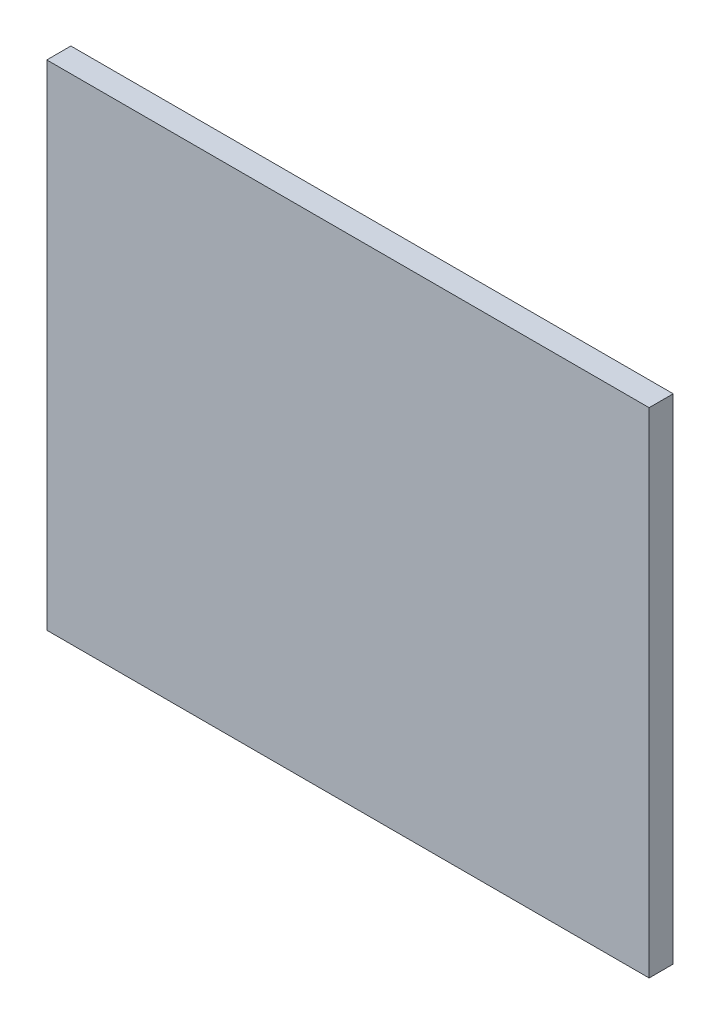
ISO-10303-21;
HEADER;
FILE_DESCRIPTION(('STEP AP214'),'2;1');
FILE_NAME('part.step','',(''),(''),'','','');
FILE_SCHEMA(('AUTOMOTIVE_DESIGN { 1 0 10303 214 1 1 1 1 }'));
ENDSEC;
DATA;
#1=APPLICATION_CONTEXT('core data for automotive mechanical design processes');
#2=APPLICATION_PROTOCOL_DEFINITION('international standard','automotive_design',2000,#1);
#3=PRODUCT_CONTEXT('',#1,'mechanical');
#4=PRODUCT('Part','Part','',(#3));
#5=PRODUCT_RELATED_PRODUCT_CATEGORY('part','',(#4));
#6=PRODUCT_DEFINITION_FORMATION('','',#4);
#7=PRODUCT_DEFINITION_CONTEXT('part definition',#1,'design');
#8=PRODUCT_DEFINITION('design','',#6,#7);
#9=PRODUCT_DEFINITION_SHAPE('','',#8);
#10=(LENGTH_UNIT() NAMED_UNIT(*) SI_UNIT(.MILLI.,.METRE.));
#11=(NAMED_UNIT(*) PLANE_ANGLE_UNIT() SI_UNIT($,.RADIAN.));
#12=(NAMED_UNIT(*) SI_UNIT($,.STERADIAN.) SOLID_ANGLE_UNIT());
#13=UNCERTAINTY_MEASURE_WITH_UNIT(LENGTH_MEASURE(1.E-05),#10,'distance_accuracy_value','');
#14=(GEOMETRIC_REPRESENTATION_CONTEXT(3) GLOBAL_UNCERTAINTY_ASSIGNED_CONTEXT((#13)) GLOBAL_UNIT_ASSIGNED_CONTEXT((#10,
#11,#12)) REPRESENTATION_CONTEXT('',''));
#15=CARTESIAN_POINT('',(0.,0.,0.));
#16=DIRECTION('',(0.,0.,1.));
#17=DIRECTION('',(1.,0.,0.));
#18=AXIS2_PLACEMENT_3D('',#15,#16,#17);
#19=CARTESIAN_POINT('',(20.,-10.25,1.));
#20=DIRECTION('',(-1.,0.,0.));
#21=DIRECTION('',(0.,0.,1.));
#22=AXIS2_PLACEMENT_3D('',#19,#20,#21);
#23=PLANE('',#22);
#24=DIRECTION('',(0.,1.,0.));
#25=VECTOR('',#24,1.);
#26=CARTESIAN_POINT('',(20.,-10.25,0.));
#27=LINE('',#26,#25);
#28=CARTESIAN_POINT('',(20.,-10.25,0.));
#29=VERTEX_POINT('',#28);
#30=CARTESIAN_POINT('',(20.,10.25,0.));
#31=VERTEX_POINT('',#30);
#32=EDGE_CURVE('E97',#29,#31,#27,.T.);
#33=ORIENTED_EDGE('',*,*,#32,.T.);
#34=DIRECTION('',(0.,0.,-1.));
#35=VECTOR('',#34,1.);
#36=CARTESIAN_POINT('',(20.,10.25,1.));
#37=LINE('',#36,#35);
#38=CARTESIAN_POINT('',(20.,10.25,1.));
#39=VERTEX_POINT('',#38);
#40=EDGE_CURVE('E11',#39,#31,#37,.T.);
#41=ORIENTED_EDGE('',*,*,#40,.F.);
#42=DIRECTION('',(0.,1.,0.));
#43=VECTOR('',#42,1.);
#44=CARTESIAN_POINT('',(20.,-10.25,1.));
#45=LINE('',#44,#43);
#46=CARTESIAN_POINT('',(20.,-10.25,1.));
#47=VERTEX_POINT('',#46);
#48=EDGE_CURVE('E85',#47,#39,#45,.T.);
#49=ORIENTED_EDGE('',*,*,#48,.F.);
#50=DIRECTION('',(0.,0.,-1.));
#51=VECTOR('',#50,1.);
#52=CARTESIAN_POINT('',(20.,-10.25,1.));
#53=LINE('',#52,#51);
#54=EDGE_CURVE('E93',#47,#29,#53,.T.);
#55=ORIENTED_EDGE('',*,*,#54,.T.);
#56=EDGE_LOOP('',(#33,#41,#49,#55));
#57=FACE_BOUND('',#56,.T.);
#58=ADVANCED_FACE('F34',(#57),#23,.F.);
#59=CARTESIAN_POINT('',(-5.,10.25,1.));
#60=DIRECTION('',(0.,-1.,0.));
#61=DIRECTION('',(0.,0.,-1.));
#62=AXIS2_PLACEMENT_3D('',#59,#60,#61);
#63=PLANE('',#62);
#64=DIRECTION('',(-1.,0.,0.));
#65=VECTOR('',#64,1.);
#66=CARTESIAN_POINT('',(-5.,10.25,0.));
#67=LINE('',#66,#65);
#68=CARTESIAN_POINT('',(-5.,10.25,0.));
#69=VERTEX_POINT('',#68);
#70=EDGE_CURVE('E89',#31,#69,#67,.T.);
#71=ORIENTED_EDGE('',*,*,#70,.T.);
#72=DIRECTION('',(0.,0.,-1.));
#73=VECTOR('',#72,1.);
#74=CARTESIAN_POINT('',(-5.,10.25,1.));
#75=LINE('',#74,#73);
#76=CARTESIAN_POINT('',(-5.,10.25,1.));
#77=VERTEX_POINT('',#76);
#78=EDGE_CURVE('E42',#77,#69,#75,.T.);
#79=ORIENTED_EDGE('',*,*,#78,.F.);
#80=DIRECTION('',(-1.,0.,0.));
#81=VECTOR('',#80,1.);
#82=CARTESIAN_POINT('',(-5.,10.25,1.));
#83=LINE('',#82,#81);
#84=EDGE_CURVE('E80',#39,#77,#83,.T.);
#85=ORIENTED_EDGE('',*,*,#84,.F.);
#86=ORIENTED_EDGE('',*,*,#40,.T.);
#87=EDGE_LOOP('',(#71,#79,#85,#86));
#88=FACE_BOUND('',#87,.T.);
#89=ADVANCED_FACE('F88',(#88),#63,.F.);
#90=CARTESIAN_POINT('',(-5.,-10.25,1.));
#91=DIRECTION('',(1.,0.,0.));
#92=DIRECTION('',(0.,0.,-1.));
#93=AXIS2_PLACEMENT_3D('',#90,#91,#92);
#94=PLANE('',#93);
#95=DIRECTION('',(0.,-1.,0.));
#96=VECTOR('',#95,1.);
#97=CARTESIAN_POINT('',(-5.,-10.25,0.));
#98=LINE('',#97,#96);
#99=CARTESIAN_POINT('',(-5.,-10.25,0.));
#100=VERTEX_POINT('',#99);
#101=EDGE_CURVE('E67',#69,#100,#98,.T.);
#102=ORIENTED_EDGE('',*,*,#101,.T.);
#103=DIRECTION('',(0.,0.,-1.));
#104=VECTOR('',#103,1.);
#105=CARTESIAN_POINT('',(-5.,-10.25,1.));
#106=LINE('',#105,#104);
#107=CARTESIAN_POINT('',(-5.,-10.25,1.));
#108=VERTEX_POINT('',#107);
#109=EDGE_CURVE('E90',#108,#100,#106,.T.);
#110=ORIENTED_EDGE('',*,*,#109,.F.);
#111=DIRECTION('',(0.,-1.,0.));
#112=VECTOR('',#111,1.);
#113=CARTESIAN_POINT('',(-5.,-10.25,1.));
#114=LINE('',#113,#112);
#115=EDGE_CURVE('E83',#77,#108,#114,.T.);
#116=ORIENTED_EDGE('',*,*,#115,.F.);
#117=ORIENTED_EDGE('',*,*,#78,.T.);
#118=EDGE_LOOP('',(#102,#110,#116,#117));
#119=FACE_BOUND('',#118,.T.);
#120=ADVANCED_FACE('F91',(#119),#94,.F.);
#121=CARTESIAN_POINT('',(-5.,-10.25,1.));
#122=DIRECTION('',(0.,1.,0.));
#123=DIRECTION('',(0.,0.,1.));
#124=AXIS2_PLACEMENT_3D('',#121,#122,#123);
#125=PLANE('',#124);
#126=DIRECTION('',(1.,0.,0.));
#127=VECTOR('',#126,1.);
#128=CARTESIAN_POINT('',(-5.,-10.25,0.));
#129=LINE('',#128,#127);
#130=EDGE_CURVE('E73',#100,#29,#129,.T.);
#131=ORIENTED_EDGE('',*,*,#130,.T.);
#132=ORIENTED_EDGE('',*,*,#54,.F.);
#133=DIRECTION('',(1.,0.,0.));
#134=VECTOR('',#133,1.);
#135=CARTESIAN_POINT('',(-5.,-10.25,1.));
#136=LINE('',#135,#134);
#137=EDGE_CURVE('E50',#108,#47,#136,.T.);
#138=ORIENTED_EDGE('',*,*,#137,.F.);
#139=ORIENTED_EDGE('',*,*,#109,.T.);
#140=EDGE_LOOP('',(#131,#132,#138,#139));
#141=FACE_BOUND('',#140,.T.);
#142=ADVANCED_FACE('F104',(#141),#125,.F.);
#143=CARTESIAN_POINT('',(0.,0.,1.));
#144=DIRECTION('',(0.,0.,-1.));
#145=DIRECTION('',(-1.,0.,0.));
#146=AXIS2_PLACEMENT_3D('',#143,#144,#145);
#147=PLANE('',#146);
#148=ORIENTED_EDGE('',*,*,#48,.T.);
#149=ORIENTED_EDGE('',*,*,#84,.T.);
#150=ORIENTED_EDGE('',*,*,#115,.T.);
#151=ORIENTED_EDGE('',*,*,#137,.T.);
#152=EDGE_LOOP('',(#148,#149,#150,#151));
#153=FACE_BOUND('',#152,.T.);
#154=ADVANCED_FACE('F81',(#153),#147,.F.);
#155=CARTESIAN_POINT('',(0.,0.,0.));
#156=DIRECTION('',(0.,0.,-1.));
#157=DIRECTION('',(-1.,0.,0.));
#158=AXIS2_PLACEMENT_3D('',#155,#156,#157);
#159=PLANE('',#158);
#160=ORIENTED_EDGE('',*,*,#32,.F.);
#161=ORIENTED_EDGE('',*,*,#130,.F.);
#162=ORIENTED_EDGE('',*,*,#101,.F.);
#163=ORIENTED_EDGE('',*,*,#70,.F.);
#164=EDGE_LOOP('',(#160,#161,#162,#163));
#165=FACE_BOUND('',#164,.T.);
#166=ADVANCED_FACE('F107',(#165),#159,.T.);
#167=CLOSED_SHELL('',(#58,#89,#120,#142,#154,#166));
#168=MANIFOLD_SOLID_BREP('B2',#167);
#169=ADVANCED_BREP_SHAPE_REPRESENTATION('',(#18,#168),#14);
#170=SHAPE_DEFINITION_REPRESENTATION(#9,#169);
ENDSEC;
END-ISO-10303-21;
